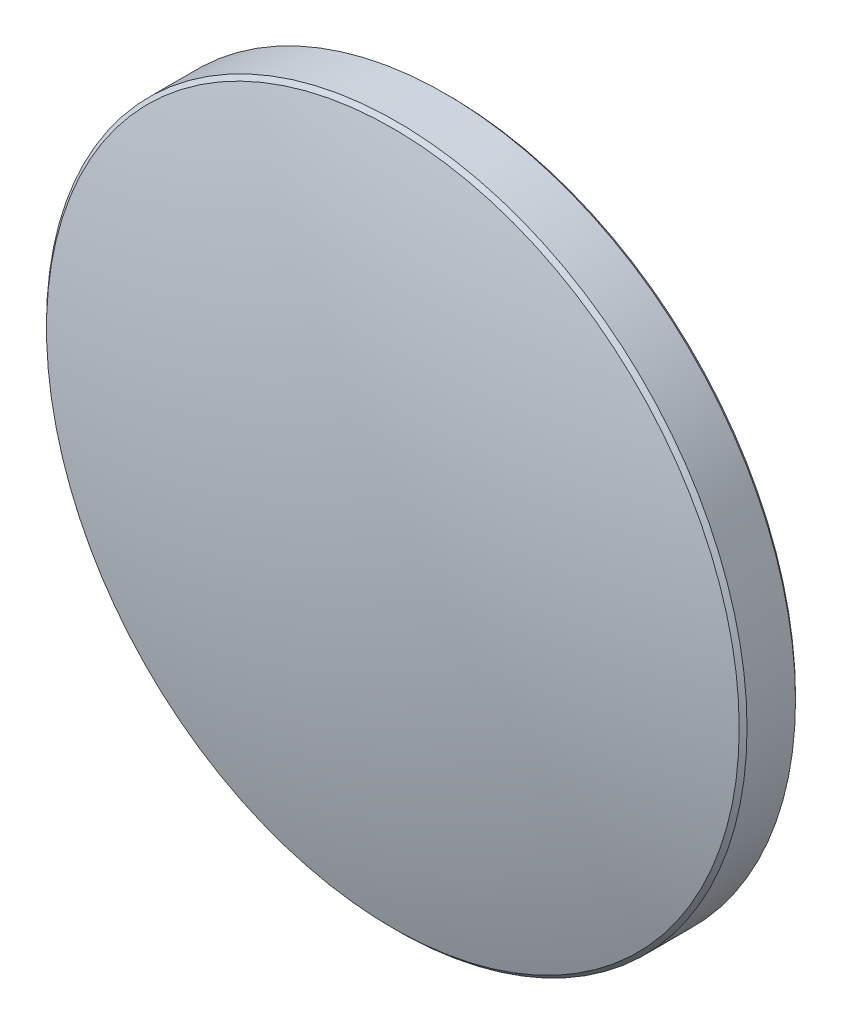
ISO-10303-21;
HEADER;
FILE_DESCRIPTION(('STEP AP214'),'2;1');
FILE_NAME('part.step','',(''),(''),'','','');
FILE_SCHEMA(('AUTOMOTIVE_DESIGN { 1 0 10303 214 1 1 1 1 }'));
ENDSEC;
DATA;
#1=APPLICATION_CONTEXT('core data for automotive mechanical design processes');
#2=APPLICATION_PROTOCOL_DEFINITION('international standard','automotive_design',2000,#1);
#3=PRODUCT_CONTEXT('',#1,'mechanical');
#4=PRODUCT('Part','Part','',(#3));
#5=PRODUCT_RELATED_PRODUCT_CATEGORY('part','',(#4));
#6=PRODUCT_DEFINITION_FORMATION('','',#4);
#7=PRODUCT_DEFINITION_CONTEXT('part definition',#1,'design');
#8=PRODUCT_DEFINITION('design','',#6,#7);
#9=PRODUCT_DEFINITION_SHAPE('','',#8);
#10=(LENGTH_UNIT() NAMED_UNIT(*) SI_UNIT(.MILLI.,.METRE.));
#11=(NAMED_UNIT(*) PLANE_ANGLE_UNIT() SI_UNIT($,.RADIAN.));
#12=(NAMED_UNIT(*) SI_UNIT($,.STERADIAN.) SOLID_ANGLE_UNIT());
#13=UNCERTAINTY_MEASURE_WITH_UNIT(LENGTH_MEASURE(1.E-05),#10,'distance_accuracy_value','');
#14=(GEOMETRIC_REPRESENTATION_CONTEXT(3) GLOBAL_UNCERTAINTY_ASSIGNED_CONTEXT((#13)) GLOBAL_UNIT_ASSIGNED_CONTEXT((#10,
#11,#12)) REPRESENTATION_CONTEXT('',''));
#15=CARTESIAN_POINT('',(0.,0.,0.));
#16=DIRECTION('',(0.,0.,1.));
#17=DIRECTION('',(1.,0.,0.));
#18=AXIS2_PLACEMENT_3D('',#15,#16,#17);
#19=CARTESIAN_POINT('',(-0.00872822977051116,0.,-44.1149991721148));
#20=DIRECTION('',(0.,-1.,0.));
#21=DIRECTION('',(1.,0.,0.));
#22=AXIS2_PLACEMENT_3D('',#19,#20,#21);
#23=CIRCLE('',#22,46.01);
#24=TRIMMED_CURVE('',#23,(PARAMETER_VALUE(-1.57060662390807)),
(PARAMETER_VALUE(1.57060662390807)),.T.,.PARAMETER.);
#25=CARTESIAN_POINT('',(0.,0.,-44.1149991721148));
#26=DIRECTION('',(0.,0.,1.));
#27=AXIS1_PLACEMENT('',#25,#26);
#28=SURFACE_OF_REVOLUTION('',#24,#27);
#29=CARTESIAN_POINT('',(0.,0.,1.895));
#30=VERTEX_POINT('',#29);
#31=VERTEX_LOOP('',#30);
#32=FACE_BOUND('',#31,.T.);
#33=CARTESIAN_POINT('',(0.,0.,0.145399582826895));
#34=DIRECTION('',(0.,0.,1.));
#35=DIRECTION('',(1.,0.,0.));
#36=AXIS2_PLACEMENT_3D('',#33,#34,#35);
#37=CIRCLE('',#36,12.5585786437627);
#38=CARTESIAN_POINT('',(12.5585786437627,0.,0.145399582826895));
#39=VERTEX_POINT('',#38);
#40=EDGE_CURVE('E29',#39,#39,#37,.T.);
#41=ORIENTED_EDGE('',*,*,#40,.T.);
#42=EDGE_LOOP('',(#41));
#43=FACE_BOUND('',#42,.T.);
#44=ADVANCED_FACE('F15',(#32,#43),#28,.T.);
#45=CARTESIAN_POINT('',(0.,0.,-1.895));
#46=DIRECTION('',(0.,0.,1.));
#47=DIRECTION('',(1.,0.,0.));
#48=AXIS2_PLACEMENT_3D('',#45,#46,#47);
#49=PLANE('',#48);
#50=CARTESIAN_POINT('',(0.,0.,-1.895));
#51=DIRECTION('',(0.,0.,1.));
#52=DIRECTION('',(1.,0.,0.));
#53=AXIS2_PLACEMENT_3D('',#50,#51,#52);
#54=CIRCLE('',#53,12.5585786437627);
#55=CARTESIAN_POINT('',(12.5585786437627,0.,-1.895));
#56=VERTEX_POINT('',#55);
#57=EDGE_CURVE('E10',#56,#56,#54,.T.);
#58=ORIENTED_EDGE('',*,*,#57,.F.);
#59=EDGE_LOOP('',(#58));
#60=FACE_BOUND('',#59,.T.);
#61=ADVANCED_FACE('F26',(#60),#49,.F.);
#62=CARTESIAN_POINT('',(0.,0.,-1.895));
#63=DIRECTION('',(0.,0.,1.));
#64=DIRECTION('',(1.,0.,0.));
#65=AXIS2_PLACEMENT_3D('',#62,#63,#64);
#66=CONICAL_SURFACE('',#65,12.5585786437627,0.785398163397436);
#67=CARTESIAN_POINT('',(0.,0.,-1.75357864376269));
#68=DIRECTION('',(0.,0.,1.));
#69=DIRECTION('',(1.,0.,0.));
#70=AXIS2_PLACEMENT_3D('',#67,#68,#69);
#71=CIRCLE('',#70,12.7);
#72=CARTESIAN_POINT('',(12.7,0.,-1.75357864376269));
#73=VERTEX_POINT('',#72);
#74=EDGE_CURVE('E21',#73,#73,#71,.T.);
#75=ORIENTED_EDGE('',*,*,#74,.F.);
#76=EDGE_LOOP('',(#75));
#77=FACE_BOUND('',#76,.T.);
#78=ORIENTED_EDGE('',*,*,#57,.T.);
#79=EDGE_LOOP('',(#78));
#80=FACE_BOUND('',#79,.T.);
#81=ADVANCED_FACE('F40',(#77,#80),#66,.T.);
#82=CARTESIAN_POINT('',(0.,0.,35.7225457687));
#83=DIRECTION('',(0.,0.,1.));
#84=DIRECTION('',(1.,0.,0.));
#85=AXIS2_PLACEMENT_3D('',#82,#83,#84);
#86=CYLINDRICAL_SURFACE('',#85,12.7);
#87=CARTESIAN_POINT('',(0.,0.,0.00397822658958213));
#88=DIRECTION('',(0.,0.,1.));
#89=DIRECTION('',(1.,0.,0.));
#90=AXIS2_PLACEMENT_3D('',#87,#88,#89);
#91=CIRCLE('',#90,12.7);
#92=CARTESIAN_POINT('',(12.7,0.,0.00397822658958213));
#93=VERTEX_POINT('',#92);
#94=EDGE_CURVE('E31',#93,#93,#91,.T.);
#95=ORIENTED_EDGE('',*,*,#94,.F.);
#96=EDGE_LOOP('',(#95));
#97=FACE_BOUND('',#96,.T.);
#98=ORIENTED_EDGE('',*,*,#74,.T.);
#99=EDGE_LOOP('',(#98));
#100=FACE_BOUND('',#99,.T.);
#101=ADVANCED_FACE('F38',(#97,#100),#86,.T.);
#102=CARTESIAN_POINT('',(0.,0.,0.00397822658958213));
#103=DIRECTION('',(0.,0.,-1.));
#104=DIRECTION('',(-1.,0.,0.));
#105=AXIS2_PLACEMENT_3D('',#102,#103,#104);
#106=CONICAL_SURFACE('',#105,12.7,0.78539816339743);
#107=ORIENTED_EDGE('',*,*,#40,.F.);
#108=EDGE_LOOP('',(#107));
#109=FACE_BOUND('',#108,.T.);
#110=ORIENTED_EDGE('',*,*,#94,.T.);
#111=EDGE_LOOP('',(#110));
#112=FACE_BOUND('',#111,.T.);
#113=ADVANCED_FACE('F54',(#109,#112),#106,.T.);
#114=CLOSED_SHELL('',(#44,#61,#81,#101,#113));
#115=MANIFOLD_SOLID_BREP('B1',#114);
#116=ADVANCED_BREP_SHAPE_REPRESENTATION('',(#18,#115),#14);
#117=SHAPE_DEFINITION_REPRESENTATION(#9,#116);
ENDSEC;
END-ISO-10303-21;
